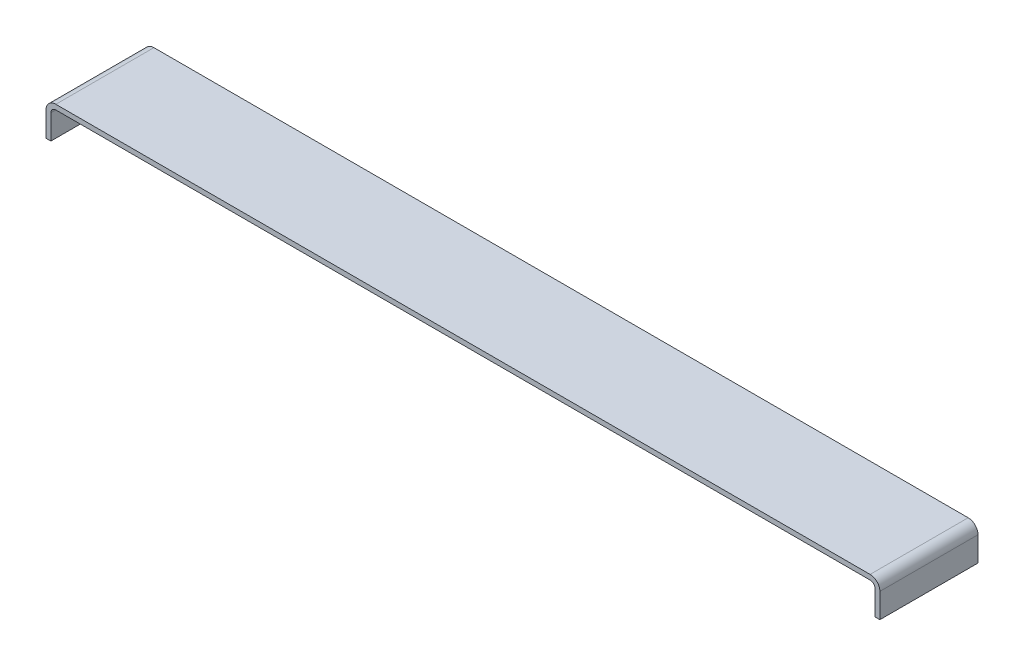
ISO-10303-21;
HEADER;
FILE_DESCRIPTION(('STEP AP214'),'2;1');
FILE_NAME('part.step','',(''),(''),'','','');
FILE_SCHEMA(('AUTOMOTIVE_DESIGN { 1 0 10303 214 1 1 1 1 }'));
ENDSEC;
DATA;
#1=APPLICATION_CONTEXT('core data for automotive mechanical design processes');
#2=APPLICATION_PROTOCOL_DEFINITION('international standard','automotive_design',2000,#1);
#3=PRODUCT_CONTEXT('',#1,'mechanical');
#4=PRODUCT('Part','Part','',(#3));
#5=PRODUCT_RELATED_PRODUCT_CATEGORY('part','',(#4));
#6=PRODUCT_DEFINITION_FORMATION('','',#4);
#7=PRODUCT_DEFINITION_CONTEXT('part definition',#1,'design');
#8=PRODUCT_DEFINITION('design','',#6,#7);
#9=PRODUCT_DEFINITION_SHAPE('','',#8);
#10=(LENGTH_UNIT() NAMED_UNIT(*) SI_UNIT(.MILLI.,.METRE.));
#11=(NAMED_UNIT(*) PLANE_ANGLE_UNIT() SI_UNIT($,.RADIAN.));
#12=(NAMED_UNIT(*) SI_UNIT($,.STERADIAN.) SOLID_ANGLE_UNIT());
#13=UNCERTAINTY_MEASURE_WITH_UNIT(LENGTH_MEASURE(1.E-05),#10,'distance_accuracy_value','');
#14=(GEOMETRIC_REPRESENTATION_CONTEXT(3) GLOBAL_UNCERTAINTY_ASSIGNED_CONTEXT((#13)) GLOBAL_UNIT_ASSIGNED_CONTEXT((#10,
#11,#12)) REPRESENTATION_CONTEXT('',''));
#15=CARTESIAN_POINT('',(0.,0.,0.));
#16=DIRECTION('',(0.,0.,1.));
#17=DIRECTION('',(1.,0.,0.));
#18=AXIS2_PLACEMENT_3D('',#15,#16,#17);
#19=CARTESIAN_POINT('',(0.,0.,20.));
#20=DIRECTION('',(0.,1.,0.));
#21=DIRECTION('',(0.,0.,1.));
#22=AXIS2_PLACEMENT_3D('',#19,#20,#21);
#23=PLANE('',#22);
#24=DIRECTION('',(1.,0.,0.));
#25=VECTOR('',#24,1.);
#26=CARTESIAN_POINT('',(0.,0.,0.));
#27=LINE('',#26,#25);
#28=CARTESIAN_POINT('',(0.,0.,0.));
#29=VERTEX_POINT('',#28);
#30=CARTESIAN_POINT('',(1.,0.,0.));
#31=VERTEX_POINT('',#30);
#32=EDGE_CURVE('E153',#29,#31,#27,.T.);
#33=ORIENTED_EDGE('',*,*,#32,.T.);
#34=DIRECTION('',(0.,0.,-1.));
#35=VECTOR('',#34,1.);
#36=CARTESIAN_POINT('',(1.,0.,20.));
#37=LINE('',#36,#35);
#38=CARTESIAN_POINT('',(1.,0.,20.));
#39=VERTEX_POINT('',#38);
#40=EDGE_CURVE('E11',#39,#31,#37,.T.);
#41=ORIENTED_EDGE('',*,*,#40,.F.);
#42=DIRECTION('',(1.,0.,0.));
#43=VECTOR('',#42,1.);
#44=CARTESIAN_POINT('',(0.,0.,20.));
#45=LINE('',#44,#43);
#46=CARTESIAN_POINT('',(0.,0.,20.));
#47=VERTEX_POINT('',#46);
#48=EDGE_CURVE('E175',#47,#39,#45,.T.);
#49=ORIENTED_EDGE('',*,*,#48,.F.);
#50=DIRECTION('',(0.,0.,-1.));
#51=VECTOR('',#50,1.);
#52=CARTESIAN_POINT('',(0.,0.,20.));
#53=LINE('',#52,#51);
#54=EDGE_CURVE('E149',#47,#29,#53,.T.);
#55=ORIENTED_EDGE('',*,*,#54,.T.);
#56=EDGE_LOOP('',(#33,#41,#49,#55));
#57=FACE_BOUND('',#56,.T.);
#58=ADVANCED_FACE('F33',(#57),#23,.F.);
#59=CARTESIAN_POINT('',(1.,0.,20.));
#60=DIRECTION('',(-1.,0.,0.));
#61=DIRECTION('',(0.,0.,1.));
#62=AXIS2_PLACEMENT_3D('',#59,#60,#61);
#63=PLANE('',#62);
#64=DIRECTION('',(0.,1.,0.));
#65=VECTOR('',#64,1.);
#66=CARTESIAN_POINT('',(1.,0.,0.));
#67=LINE('',#66,#65);
#68=CARTESIAN_POINT('',(1.,4.99999999999999,0.));
#69=VERTEX_POINT('',#68);
#70=EDGE_CURVE('E156',#31,#69,#67,.T.);
#71=ORIENTED_EDGE('',*,*,#70,.T.);
#72=DIRECTION('',(0.,0.,-1.));
#73=VECTOR('',#72,1.);
#74=CARTESIAN_POINT('',(1.,4.99999999999999,20.));
#75=LINE('',#74,#73);
#76=CARTESIAN_POINT('',(1.,4.99999999999999,20.));
#77=VERTEX_POINT('',#76);
#78=EDGE_CURVE('E41',#77,#69,#75,.T.);
#79=ORIENTED_EDGE('',*,*,#78,.F.);
#80=DIRECTION('',(0.,1.,0.));
#81=VECTOR('',#80,1.);
#82=CARTESIAN_POINT('',(1.,0.,20.));
#83=LINE('',#82,#81);
#84=EDGE_CURVE('E104',#39,#77,#83,.T.);
#85=ORIENTED_EDGE('',*,*,#84,.F.);
#86=ORIENTED_EDGE('',*,*,#40,.T.);
#87=EDGE_LOOP('',(#71,#79,#85,#86));
#88=FACE_BOUND('',#87,.T.);
#89=ADVANCED_FACE('F253',(#88),#63,.F.);
#90=CARTESIAN_POINT('',(2.,5.,20.));
#91=DIRECTION('',(0.,0.,-1.));
#92=DIRECTION('',(-1.,0.,0.));
#93=AXIS2_PLACEMENT_3D('',#90,#91,#92);
#94=CYLINDRICAL_SURFACE('',#93,1.);
#95=CARTESIAN_POINT('',(2.,5.,0.));
#96=DIRECTION('',(0.,0.,-1.));
#97=DIRECTION('',(1.,0.,0.));
#98=AXIS2_PLACEMENT_3D('',#95,#96,#97);
#99=CIRCLE('',#98,1.);
#100=CARTESIAN_POINT('',(2.00000000000001,6.,0.));
#101=VERTEX_POINT('',#100);
#102=EDGE_CURVE('E158',#69,#101,#99,.T.);
#103=ORIENTED_EDGE('',*,*,#102,.T.);
#104=DIRECTION('',(0.,0.,-1.));
#105=VECTOR('',#104,1.);
#106=CARTESIAN_POINT('',(2.00000000000001,6.,20.));
#107=LINE('',#106,#105);
#108=CARTESIAN_POINT('',(2.00000000000001,6.,20.));
#109=VERTEX_POINT('',#108);
#110=EDGE_CURVE('E194',#109,#101,#107,.T.);
#111=ORIENTED_EDGE('',*,*,#110,.F.);
#112=CARTESIAN_POINT('',(2.,5.,20.));
#113=DIRECTION('',(0.,0.,-1.));
#114=DIRECTION('',(1.,0.,0.));
#115=AXIS2_PLACEMENT_3D('',#112,#113,#114);
#116=CIRCLE('',#115,1.);
#117=EDGE_CURVE('E202',#77,#109,#116,.T.);
#118=ORIENTED_EDGE('',*,*,#117,.F.);
#119=ORIENTED_EDGE('',*,*,#78,.T.);
#120=EDGE_LOOP('',(#103,#111,#118,#119));
#121=FACE_BOUND('',#120,.T.);
#122=ADVANCED_FACE('F200',(#121),#94,.F.);
#123=CARTESIAN_POINT('',(2.00000000000001,6.,20.));
#124=DIRECTION('',(0.,1.,0.));
#125=DIRECTION('',(0.,0.,1.));
#126=AXIS2_PLACEMENT_3D('',#123,#124,#125);
#127=PLANE('',#126);
#128=DIRECTION('',(1.,0.,0.));
#129=VECTOR('',#128,1.);
#130=CARTESIAN_POINT('',(2.00000000000001,6.,0.));
#131=LINE('',#130,#129);
#132=CARTESIAN_POINT('',(168.,6.,0.));
#133=VERTEX_POINT('',#132);
#134=EDGE_CURVE('E160',#101,#133,#131,.T.);
#135=ORIENTED_EDGE('',*,*,#134,.T.);
#136=DIRECTION('',(0.,0.,-1.));
#137=VECTOR('',#136,1.);
#138=CARTESIAN_POINT('',(168.,6.,20.));
#139=LINE('',#138,#137);
#140=CARTESIAN_POINT('',(168.,6.,20.));
#141=VERTEX_POINT('',#140);
#142=EDGE_CURVE('E191',#141,#133,#139,.T.);
#143=ORIENTED_EDGE('',*,*,#142,.F.);
#144=DIRECTION('',(1.,0.,0.));
#145=VECTOR('',#144,1.);
#146=CARTESIAN_POINT('',(2.00000000000001,6.,20.));
#147=LINE('',#146,#145);
#148=EDGE_CURVE('E220',#109,#141,#147,.T.);
#149=ORIENTED_EDGE('',*,*,#148,.F.);
#150=ORIENTED_EDGE('',*,*,#110,.T.);
#151=EDGE_LOOP('',(#135,#143,#149,#150));
#152=FACE_BOUND('',#151,.T.);
#153=ADVANCED_FACE('F211',(#152),#127,.F.);
#154=CARTESIAN_POINT('',(168.,5.,20.));
#155=DIRECTION('',(0.,0.,-1.));
#156=DIRECTION('',(-1.,0.,0.));
#157=AXIS2_PLACEMENT_3D('',#154,#155,#156);
#158=CYLINDRICAL_SURFACE('',#157,1.);
#159=CARTESIAN_POINT('',(168.,5.,0.));
#160=DIRECTION('',(0.,0.,-1.));
#161=DIRECTION('',(1.,0.,0.));
#162=AXIS2_PLACEMENT_3D('',#159,#160,#161);
#163=CIRCLE('',#162,1.);
#164=CARTESIAN_POINT('',(169.,4.99999999999999,0.));
#165=VERTEX_POINT('',#164);
#166=EDGE_CURVE('E162',#133,#165,#163,.T.);
#167=ORIENTED_EDGE('',*,*,#166,.T.);
#168=DIRECTION('',(0.,0.,-1.));
#169=VECTOR('',#168,1.);
#170=CARTESIAN_POINT('',(169.,4.99999999999999,20.));
#171=LINE('',#170,#169);
#172=CARTESIAN_POINT('',(169.,4.99999999999999,20.));
#173=VERTEX_POINT('',#172);
#174=EDGE_CURVE('E188',#173,#165,#171,.T.);
#175=ORIENTED_EDGE('',*,*,#174,.F.);
#176=CARTESIAN_POINT('',(168.,5.,20.));
#177=DIRECTION('',(0.,0.,-1.));
#178=DIRECTION('',(1.,0.,0.));
#179=AXIS2_PLACEMENT_3D('',#176,#177,#178);
#180=CIRCLE('',#179,1.);
#181=EDGE_CURVE('E217',#141,#173,#180,.T.);
#182=ORIENTED_EDGE('',*,*,#181,.F.);
#183=ORIENTED_EDGE('',*,*,#142,.T.);
#184=EDGE_LOOP('',(#167,#175,#182,#183));
#185=FACE_BOUND('',#184,.T.);
#186=ADVANCED_FACE('F215',(#185),#158,.F.);
#187=CARTESIAN_POINT('',(169.,4.99999999999999,20.));
#188=DIRECTION('',(1.,0.,0.));
#189=DIRECTION('',(0.,0.,-1.));
#190=AXIS2_PLACEMENT_3D('',#187,#188,#189);
#191=PLANE('',#190);
#192=DIRECTION('',(0.,-1.,0.));
#193=VECTOR('',#192,1.);
#194=CARTESIAN_POINT('',(169.,4.99999999999999,0.));
#195=LINE('',#194,#193);
#196=CARTESIAN_POINT('',(169.,0.,0.));
#197=VERTEX_POINT('',#196);
#198=EDGE_CURVE('E164',#165,#197,#195,.T.);
#199=ORIENTED_EDGE('',*,*,#198,.T.);
#200=DIRECTION('',(0.,0.,-1.));
#201=VECTOR('',#200,1.);
#202=CARTESIAN_POINT('',(169.,0.,20.));
#203=LINE('',#202,#201);
#204=CARTESIAN_POINT('',(169.,0.,20.));
#205=VERTEX_POINT('',#204);
#206=EDGE_CURVE('E185',#205,#197,#203,.T.);
#207=ORIENTED_EDGE('',*,*,#206,.F.);
#208=DIRECTION('',(0.,-1.,0.));
#209=VECTOR('',#208,1.);
#210=CARTESIAN_POINT('',(169.,4.99999999999999,20.));
#211=LINE('',#210,#209);
#212=EDGE_CURVE('E219',#173,#205,#211,.T.);
#213=ORIENTED_EDGE('',*,*,#212,.F.);
#214=ORIENTED_EDGE('',*,*,#174,.T.);
#215=EDGE_LOOP('',(#199,#207,#213,#214));
#216=FACE_BOUND('',#215,.T.);
#217=ADVANCED_FACE('F266',(#216),#191,.F.);
#218=CARTESIAN_POINT('',(169.,0.,20.));
#219=DIRECTION('',(0.,1.,0.));
#220=DIRECTION('',(0.,0.,1.));
#221=AXIS2_PLACEMENT_3D('',#218,#219,#220);
#222=PLANE('',#221);
#223=DIRECTION('',(1.,0.,0.));
#224=VECTOR('',#223,1.);
#225=CARTESIAN_POINT('',(169.,0.,0.));
#226=LINE('',#225,#224);
#227=CARTESIAN_POINT('',(170.,0.,0.));
#228=VERTEX_POINT('',#227);
#229=EDGE_CURVE('E166',#197,#228,#226,.T.);
#230=ORIENTED_EDGE('',*,*,#229,.T.);
#231=DIRECTION('',(0.,0.,-1.));
#232=VECTOR('',#231,1.);
#233=CARTESIAN_POINT('',(170.,0.,20.));
#234=LINE('',#233,#232);
#235=CARTESIAN_POINT('',(170.,0.,20.));
#236=VERTEX_POINT('',#235);
#237=EDGE_CURVE('E182',#236,#228,#234,.T.);
#238=ORIENTED_EDGE('',*,*,#237,.F.);
#239=DIRECTION('',(1.,0.,0.));
#240=VECTOR('',#239,1.);
#241=CARTESIAN_POINT('',(169.,0.,20.));
#242=LINE('',#241,#240);
#243=EDGE_CURVE('E222',#205,#236,#242,.T.);
#244=ORIENTED_EDGE('',*,*,#243,.F.);
#245=ORIENTED_EDGE('',*,*,#206,.T.);
#246=EDGE_LOOP('',(#230,#238,#244,#245));
#247=FACE_BOUND('',#246,.T.);
#248=ADVANCED_FACE('F269',(#247),#222,.F.);
#249=CARTESIAN_POINT('',(170.,4.99999999999999,20.));
#250=DIRECTION('',(-1.,0.,0.));
#251=DIRECTION('',(0.,0.,1.));
#252=AXIS2_PLACEMENT_3D('',#249,#250,#251);
#253=PLANE('',#252);
#254=DIRECTION('',(0.,1.,0.));
#255=VECTOR('',#254,1.);
#256=CARTESIAN_POINT('',(170.,4.99999999999999,0.));
#257=LINE('',#256,#255);
#258=CARTESIAN_POINT('',(170.,4.99999999999999,0.));
#259=VERTEX_POINT('',#258);
#260=EDGE_CURVE('E168',#228,#259,#257,.T.);
#261=ORIENTED_EDGE('',*,*,#260,.T.);
#262=DIRECTION('',(0.,0.,-1.));
#263=VECTOR('',#262,1.);
#264=CARTESIAN_POINT('',(170.,4.99999999999999,20.));
#265=LINE('',#264,#263);
#266=CARTESIAN_POINT('',(170.,4.99999999999999,20.));
#267=VERTEX_POINT('',#266);
#268=EDGE_CURVE('E179',#267,#259,#265,.T.);
#269=ORIENTED_EDGE('',*,*,#268,.F.);
#270=DIRECTION('',(0.,1.,0.));
#271=VECTOR('',#270,1.);
#272=CARTESIAN_POINT('',(170.,4.99999999999999,20.));
#273=LINE('',#272,#271);
#274=EDGE_CURVE('E228',#236,#267,#273,.T.);
#275=ORIENTED_EDGE('',*,*,#274,.F.);
#276=ORIENTED_EDGE('',*,*,#237,.T.);
#277=EDGE_LOOP('',(#261,#269,#275,#276));
#278=FACE_BOUND('',#277,.T.);
#279=ADVANCED_FACE('F234',(#278),#253,.F.);
#280=CARTESIAN_POINT('',(168.,5.,20.));
#281=DIRECTION('',(0.,0.,-1.));
#282=DIRECTION('',(-1.,0.,0.));
#283=AXIS2_PLACEMENT_3D('',#280,#281,#282);
#284=CYLINDRICAL_SURFACE('',#283,2.);
#285=CARTESIAN_POINT('',(168.,5.,0.));
#286=DIRECTION('',(0.,0.,1.));
#287=DIRECTION('',(1.,0.,0.));
#288=AXIS2_PLACEMENT_3D('',#285,#286,#287);
#289=CIRCLE('',#288,2.);
#290=CARTESIAN_POINT('',(168.,7.,0.));
#291=VERTEX_POINT('',#290);
#292=EDGE_CURVE('E170',#259,#291,#289,.T.);
#293=ORIENTED_EDGE('',*,*,#292,.T.);
#294=DIRECTION('',(0.,0.,-1.));
#295=VECTOR('',#294,1.);
#296=CARTESIAN_POINT('',(168.,7.,20.));
#297=LINE('',#296,#295);
#298=CARTESIAN_POINT('',(168.,7.,20.));
#299=VERTEX_POINT('',#298);
#300=EDGE_CURVE('E144',#299,#291,#297,.T.);
#301=ORIENTED_EDGE('',*,*,#300,.F.);
#302=CARTESIAN_POINT('',(168.,5.,20.));
#303=DIRECTION('',(0.,0.,1.));
#304=DIRECTION('',(1.,0.,0.));
#305=AXIS2_PLACEMENT_3D('',#302,#303,#304);
#306=CIRCLE('',#305,2.);
#307=EDGE_CURVE('E135',#267,#299,#306,.T.);
#308=ORIENTED_EDGE('',*,*,#307,.F.);
#309=ORIENTED_EDGE('',*,*,#268,.T.);
#310=EDGE_LOOP('',(#293,#301,#308,#309));
#311=FACE_BOUND('',#310,.T.);
#312=ADVANCED_FACE('F238',(#311),#284,.T.);
#313=CARTESIAN_POINT('',(2.00000000000001,7.,20.));
#314=DIRECTION('',(0.,-1.,0.));
#315=DIRECTION('',(0.,0.,-1.));
#316=AXIS2_PLACEMENT_3D('',#313,#314,#315);
#317=PLANE('',#316);
#318=DIRECTION('',(-1.,0.,0.));
#319=VECTOR('',#318,1.);
#320=CARTESIAN_POINT('',(2.00000000000001,7.,0.));
#321=LINE('',#320,#319);
#322=CARTESIAN_POINT('',(2.00000000000001,7.,0.));
#323=VERTEX_POINT('',#322);
#324=EDGE_CURVE('E143',#291,#323,#321,.T.);
#325=ORIENTED_EDGE('',*,*,#324,.T.);
#326=DIRECTION('',(0.,0.,-1.));
#327=VECTOR('',#326,1.);
#328=CARTESIAN_POINT('',(2.00000000000001,7.,20.));
#329=LINE('',#328,#327);
#330=CARTESIAN_POINT('',(2.00000000000001,7.,20.));
#331=VERTEX_POINT('',#330);
#332=EDGE_CURVE('E140',#331,#323,#329,.T.);
#333=ORIENTED_EDGE('',*,*,#332,.F.);
#334=DIRECTION('',(-1.,0.,0.));
#335=VECTOR('',#334,1.);
#336=CARTESIAN_POINT('',(2.00000000000001,7.,20.));
#337=LINE('',#336,#335);
#338=EDGE_CURVE('E129',#299,#331,#337,.T.);
#339=ORIENTED_EDGE('',*,*,#338,.F.);
#340=ORIENTED_EDGE('',*,*,#300,.T.);
#341=EDGE_LOOP('',(#325,#333,#339,#340));
#342=FACE_BOUND('',#341,.T.);
#343=ADVANCED_FACE('F141',(#342),#317,.F.);
#344=CARTESIAN_POINT('',(2.,5.,20.));
#345=DIRECTION('',(0.,0.,-1.));
#346=DIRECTION('',(-1.,0.,0.));
#347=AXIS2_PLACEMENT_3D('',#344,#345,#346);
#348=CYLINDRICAL_SURFACE('',#347,2.);
#349=CARTESIAN_POINT('',(2.,5.,0.));
#350=DIRECTION('',(0.,0.,1.));
#351=DIRECTION('',(1.,0.,0.));
#352=AXIS2_PLACEMENT_3D('',#349,#350,#351);
#353=CIRCLE('',#352,2.);
#354=CARTESIAN_POINT('',(0.,4.99999999999999,0.));
#355=VERTEX_POINT('',#354);
#356=EDGE_CURVE('E90',#323,#355,#353,.T.);
#357=ORIENTED_EDGE('',*,*,#356,.T.);
#358=DIRECTION('',(0.,0.,-1.));
#359=VECTOR('',#358,1.);
#360=CARTESIAN_POINT('',(0.,4.99999999999999,20.));
#361=LINE('',#360,#359);
#362=CARTESIAN_POINT('',(0.,4.99999999999999,20.));
#363=VERTEX_POINT('',#362);
#364=EDGE_CURVE('E145',#363,#355,#361,.T.);
#365=ORIENTED_EDGE('',*,*,#364,.F.);
#366=CARTESIAN_POINT('',(2.,5.,20.));
#367=DIRECTION('',(0.,0.,1.));
#368=DIRECTION('',(1.,0.,0.));
#369=AXIS2_PLACEMENT_3D('',#366,#367,#368);
#370=CIRCLE('',#369,2.);
#371=EDGE_CURVE('E133',#331,#363,#370,.T.);
#372=ORIENTED_EDGE('',*,*,#371,.F.);
#373=ORIENTED_EDGE('',*,*,#332,.T.);
#374=EDGE_LOOP('',(#357,#365,#372,#373));
#375=FACE_BOUND('',#374,.T.);
#376=ADVANCED_FACE('F147',(#375),#348,.T.);
#377=CARTESIAN_POINT('',(0.,0.,20.));
#378=DIRECTION('',(1.,0.,0.));
#379=DIRECTION('',(0.,0.,-1.));
#380=AXIS2_PLACEMENT_3D('',#377,#378,#379);
#381=PLANE('',#380);
#382=DIRECTION('',(0.,-1.,0.));
#383=VECTOR('',#382,1.);
#384=CARTESIAN_POINT('',(0.,0.,0.));
#385=LINE('',#384,#383);
#386=EDGE_CURVE('E96',#355,#29,#385,.T.);
#387=ORIENTED_EDGE('',*,*,#386,.T.);
#388=ORIENTED_EDGE('',*,*,#54,.F.);
#389=DIRECTION('',(0.,-1.,0.));
#390=VECTOR('',#389,1.);
#391=CARTESIAN_POINT('',(0.,0.,20.));
#392=LINE('',#391,#390);
#393=EDGE_CURVE('E49',#363,#47,#392,.T.);
#394=ORIENTED_EDGE('',*,*,#393,.F.);
#395=ORIENTED_EDGE('',*,*,#364,.T.);
#396=EDGE_LOOP('',(#387,#388,#394,#395));
#397=FACE_BOUND('',#396,.T.);
#398=ADVANCED_FACE('F242',(#397),#381,.F.);
#399=CARTESIAN_POINT('',(2.,5.,20.));
#400=DIRECTION('',(0.,0.,1.));
#401=DIRECTION('',(1.,0.,0.));
#402=AXIS2_PLACEMENT_3D('',#399,#400,#401);
#403=PLANE('',#402);
#404=ORIENTED_EDGE('',*,*,#48,.T.);
#405=ORIENTED_EDGE('',*,*,#84,.T.);
#406=ORIENTED_EDGE('',*,*,#117,.T.);
#407=ORIENTED_EDGE('',*,*,#148,.T.);
#408=ORIENTED_EDGE('',*,*,#181,.T.);
#409=ORIENTED_EDGE('',*,*,#212,.T.);
#410=ORIENTED_EDGE('',*,*,#243,.T.);
#411=ORIENTED_EDGE('',*,*,#274,.T.);
#412=ORIENTED_EDGE('',*,*,#307,.T.);
#413=ORIENTED_EDGE('',*,*,#338,.T.);
#414=ORIENTED_EDGE('',*,*,#371,.T.);
#415=ORIENTED_EDGE('',*,*,#393,.T.);
#416=EDGE_LOOP('',(#404,#405,#406,#407,#408,#409,#410,#411,#412,#413,#414,#415));
#417=FACE_BOUND('',#416,.T.);
#418=ADVANCED_FACE('F131',(#417),#403,.T.);
#419=CARTESIAN_POINT('',(2.,5.,0.));
#420=DIRECTION('',(0.,0.,1.));
#421=DIRECTION('',(1.,0.,0.));
#422=AXIS2_PLACEMENT_3D('',#419,#420,#421);
#423=PLANE('',#422);
#424=ORIENTED_EDGE('',*,*,#32,.F.);
#425=ORIENTED_EDGE('',*,*,#386,.F.);
#426=ORIENTED_EDGE('',*,*,#356,.F.);
#427=ORIENTED_EDGE('',*,*,#324,.F.);
#428=ORIENTED_EDGE('',*,*,#292,.F.);
#429=ORIENTED_EDGE('',*,*,#260,.F.);
#430=ORIENTED_EDGE('',*,*,#229,.F.);
#431=ORIENTED_EDGE('',*,*,#198,.F.);
#432=ORIENTED_EDGE('',*,*,#166,.F.);
#433=ORIENTED_EDGE('',*,*,#134,.F.);
#434=ORIENTED_EDGE('',*,*,#102,.F.);
#435=ORIENTED_EDGE('',*,*,#70,.F.);
#436=EDGE_LOOP('',(#424,#425,#426,#427,#428,#429,#430,#431,#432,#433,#434,#435));
#437=FACE_BOUND('',#436,.T.);
#438=ADVANCED_FACE('F206',(#437),#423,.F.);
#439=CLOSED_SHELL('',(#58,#89,#122,#153,#186,#217,#248,#279,#312,#343,#376,#398,#418,#438));
#440=MANIFOLD_SOLID_BREP('B2',#439);
#441=ADVANCED_BREP_SHAPE_REPRESENTATION('',(#18,#440),#14);
#442=SHAPE_DEFINITION_REPRESENTATION(#9,#441);
ENDSEC;
END-ISO-10303-21;
